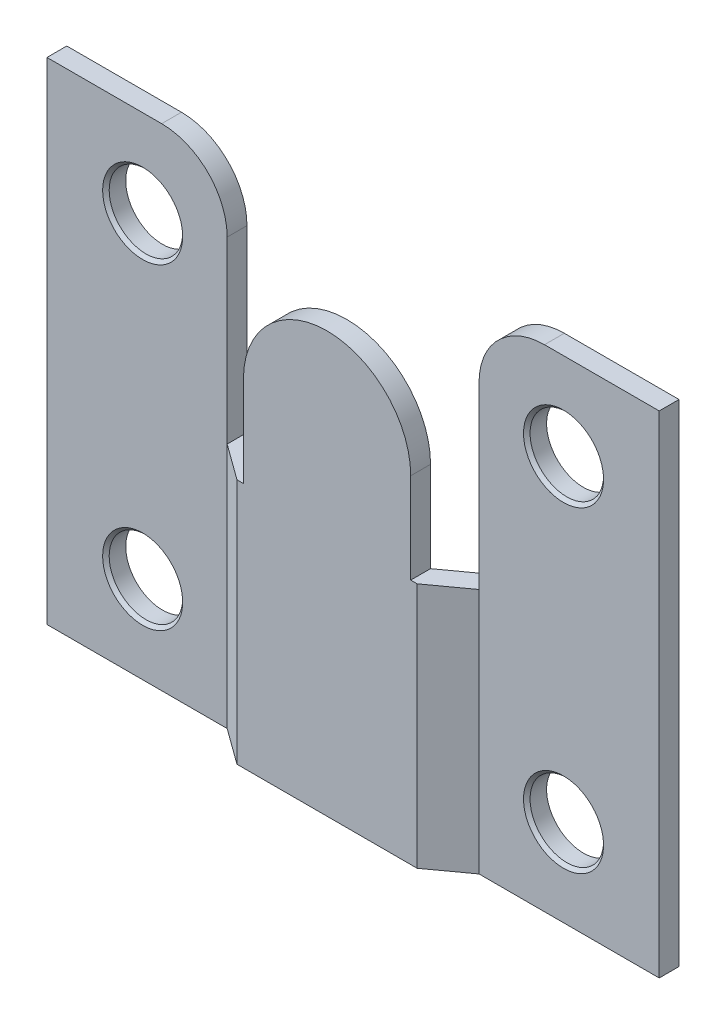
ISO-10303-21;
HEADER;
FILE_DESCRIPTION(('STEP AP214'),'2;1');
FILE_NAME('part.step','',(''),(''),'','','');
FILE_SCHEMA(('AUTOMOTIVE_DESIGN { 1 0 10303 214 1 1 1 1 }'));
ENDSEC;
DATA;
#1=APPLICATION_CONTEXT('core data for automotive mechanical design processes');
#2=APPLICATION_PROTOCOL_DEFINITION('international standard','automotive_design',2000,#1);
#3=PRODUCT_CONTEXT('',#1,'mechanical');
#4=PRODUCT('Part','Part','',(#3));
#5=PRODUCT_RELATED_PRODUCT_CATEGORY('part','',(#4));
#6=PRODUCT_DEFINITION_FORMATION('','',#4);
#7=PRODUCT_DEFINITION_CONTEXT('part definition',#1,'design');
#8=PRODUCT_DEFINITION('design','',#6,#7);
#9=PRODUCT_DEFINITION_SHAPE('','',#8);
#10=(LENGTH_UNIT() NAMED_UNIT(*) SI_UNIT(.MILLI.,.METRE.));
#11=(NAMED_UNIT(*) PLANE_ANGLE_UNIT() SI_UNIT($,.RADIAN.));
#12=(NAMED_UNIT(*) SI_UNIT($,.STERADIAN.) SOLID_ANGLE_UNIT());
#13=UNCERTAINTY_MEASURE_WITH_UNIT(LENGTH_MEASURE(1.E-05),#10,'distance_accuracy_value','');
#14=(GEOMETRIC_REPRESENTATION_CONTEXT(3) GLOBAL_UNCERTAINTY_ASSIGNED_CONTEXT((#13)) GLOBAL_UNIT_ASSIGNED_CONTEXT((#10,
#11,#12)) REPRESENTATION_CONTEXT('',''));
#15=CARTESIAN_POINT('',(0.,0.,0.));
#16=DIRECTION('',(0.,0.,1.));
#17=DIRECTION('',(1.,0.,0.));
#18=AXIS2_PLACEMENT_3D('',#15,#16,#17);
#19=CARTESIAN_POINT('',(0.,38.1,0.));
#20=DIRECTION('',(0.,-1.,0.));
#21=DIRECTION('',(0.,0.,-1.));
#22=AXIS2_PLACEMENT_3D('',#19,#20,#21);
#23=PLANE('',#22);
#24=DIRECTION('',(1.,0.,0.));
#25=VECTOR('',#24,1.);
#26=CARTESIAN_POINT('',(-9.77010987578546,38.1,-2.0193));
#27=LINE('',#26,#25);
#28=CARTESIAN_POINT('',(-23.7489999999999,38.1,-2.0193));
#29=VERTEX_POINT('',#28);
#30=CARTESIAN_POINT('',(-14.8501098757855,38.1,-2.0193));
#31=VERTEX_POINT('',#30);
#32=EDGE_CURVE('E224',#29,#31,#27,.T.);
#33=ORIENTED_EDGE('',*,*,#32,.T.);
#34=DIRECTION('',(0.,0.,-1.));
#35=VECTOR('',#34,1.);
#36=CARTESIAN_POINT('',(-14.8501098757855,38.1,0.));
#37=LINE('',#36,#35);
#38=CARTESIAN_POINT('',(-14.8501098757855,38.1,-3.55600000000001));
#39=VERTEX_POINT('',#38);
#40=EDGE_CURVE('E301',#31,#39,#37,.T.);
#41=ORIENTED_EDGE('',*,*,#40,.T.);
#42=DIRECTION('',(-1.,0.,0.));
#43=VECTOR('',#42,1.);
#44=CARTESIAN_POINT('',(-9.27099999999984,38.1,-3.55600000000001));
#45=LINE('',#44,#43);
#46=CARTESIAN_POINT('',(-23.7489999999999,38.1,-3.55600000000001));
#47=VERTEX_POINT('',#46);
#48=EDGE_CURVE('E220',#39,#47,#45,.T.);
#49=ORIENTED_EDGE('',*,*,#48,.T.);
#50=DIRECTION('',(0.,0.,1.));
#51=VECTOR('',#50,1.);
#52=CARTESIAN_POINT('',(-23.7489999999999,38.1,-3.55600000000001));
#53=LINE('',#52,#51);
#54=EDGE_CURVE('E222',#47,#29,#53,.T.);
#55=ORIENTED_EDGE('',*,*,#54,.T.);
#56=EDGE_LOOP('',(#33,#41,#49,#55));
#57=FACE_BOUND('',#56,.T.);
#58=ADVANCED_FACE('F37',(#57),#23,.F.);
#59=CARTESIAN_POINT('',(9.77010987578566,38.1,-2.01930000000001));
#60=DIRECTION('',(0.,0.,-1.));
#61=DIRECTION('',(-1.,0.,0.));
#62=AXIS2_PLACEMENT_3D('',#59,#60,#61);
#63=PLANE('',#62);
#64=CARTESIAN_POINT('',(16.32585,6.76275,-2.01930000000001));
#65=DIRECTION('',(0.,0.,-1.));
#66=DIRECTION('',(-1.,0.,0.));
#67=AXIS2_PLACEMENT_3D('',#64,#65,#66);
#68=CIRCLE('',#67,3.10514999999999);
#69=CARTESIAN_POINT('',(13.2207,6.76275,-2.01930000000001));
#70=VERTEX_POINT('',#69);
#71=EDGE_CURVE('E311',#70,#70,#68,.T.);
#72=ORIENTED_EDGE('',*,*,#71,.T.);
#73=EDGE_LOOP('',(#72));
#74=FACE_BOUND('',#73,.T.);
#75=CARTESIAN_POINT('',(16.32585,31.33725,-2.01930000000001));
#76=DIRECTION('',(0.,0.,-1.));
#77=DIRECTION('',(-1.,0.,0.));
#78=AXIS2_PLACEMENT_3D('',#75,#76,#77);
#79=CIRCLE('',#78,3.10514999999999);
#80=CARTESIAN_POINT('',(13.2207,31.33725,-2.01930000000001));
#81=VERTEX_POINT('',#80);
#82=EDGE_CURVE('E308',#81,#81,#79,.T.);
#83=ORIENTED_EDGE('',*,*,#82,.T.);
#84=EDGE_LOOP('',(#83));
#85=FACE_BOUND('',#84,.T.);
#86=DIRECTION('',(1.,0.,0.));
#87=VECTOR('',#86,1.);
#88=CARTESIAN_POINT('',(9.77010987578566,38.1,-2.01930000000001));
#89=LINE('',#88,#87);
#90=CARTESIAN_POINT('',(14.8501098757855,38.1,-2.01930000000001));
#91=VERTEX_POINT('',#90);
#92=CARTESIAN_POINT('',(23.7490000000001,38.1,-2.01930000000001));
#93=VERTEX_POINT('',#92);
#94=EDGE_CURVE('E212',#91,#93,#89,.T.);
#95=ORIENTED_EDGE('',*,*,#94,.F.);
#96=CARTESIAN_POINT('',(14.8501098757855,33.02,-2.01930000000001));
#97=DIRECTION('',(0.,0.,-1.));
#98=DIRECTION('',(-1.,0.,0.));
#99=AXIS2_PLACEMENT_3D('',#96,#97,#98);
#100=CIRCLE('',#99,5.08);
#101=CARTESIAN_POINT('',(9.77010987578566,33.02,-2.01930000000001));
#102=VERTEX_POINT('',#101);
#103=EDGE_CURVE('E299',#91,#102,#100,.F.);
#104=ORIENTED_EDGE('',*,*,#103,.T.);
#105=DIRECTION('',(0.,-1.,0.));
#106=VECTOR('',#105,1.);
#107=CARTESIAN_POINT('',(9.77010987578566,38.1,-2.01930000000001));
#108=LINE('',#107,#106);
#109=CARTESIAN_POINT('',(9.77010987578546,19.1135,-2.0193));
#110=VERTEX_POINT('',#109);
#111=EDGE_CURVE('E259',#102,#110,#108,.T.);
#112=ORIENTED_EDGE('',*,*,#111,.T.);
#113=CARTESIAN_POINT('',(9.77010987578566,0.,-2.01930000000001));
#114=VERTEX_POINT('',#113);
#115=EDGE_CURVE('E227',#110,#114,#108,.T.);
#116=ORIENTED_EDGE('',*,*,#115,.T.);
#117=DIRECTION('',(1.,0.,0.));
#118=VECTOR('',#117,1.);
#119=CARTESIAN_POINT('',(9.77010987578566,0.,-2.01930000000001));
#120=LINE('',#119,#118);
#121=CARTESIAN_POINT('',(23.7490000000001,0.,-2.01930000000001));
#122=VERTEX_POINT('',#121);
#123=EDGE_CURVE('E211',#114,#122,#120,.T.);
#124=ORIENTED_EDGE('',*,*,#123,.T.);
#125=DIRECTION('',(0.,-1.,0.));
#126=VECTOR('',#125,1.);
#127=CARTESIAN_POINT('',(23.7490000000001,38.1,-2.01930000000001));
#128=LINE('',#127,#126);
#129=EDGE_CURVE('E287',#93,#122,#128,.T.);
#130=ORIENTED_EDGE('',*,*,#129,.F.);
#131=EDGE_LOOP('',(#95,#104,#112,#116,#124,#130));
#132=FACE_BOUND('',#131,.T.);
#133=ADVANCED_FACE('F337',(#74,#85,#132),#63,.F.);
#134=CARTESIAN_POINT('',(23.7490000000001,38.1,-3.55600000000001));
#135=DIRECTION('',(-1.,0.,0.));
#136=DIRECTION('',(0.,0.,1.));
#137=AXIS2_PLACEMENT_3D('',#134,#135,#136);
#138=PLANE('',#137);
#139=DIRECTION('',(0.,0.,-1.));
#140=VECTOR('',#139,1.);
#141=CARTESIAN_POINT('',(23.7490000000001,0.,-3.55600000000001));
#142=LINE('',#141,#140);
#143=CARTESIAN_POINT('',(23.7490000000001,0.,-3.55600000000001));
#144=VERTEX_POINT('',#143);
#145=EDGE_CURVE('E230',#122,#144,#142,.T.);
#146=ORIENTED_EDGE('',*,*,#145,.T.);
#147=DIRECTION('',(0.,-1.,0.));
#148=VECTOR('',#147,1.);
#149=CARTESIAN_POINT('',(23.7490000000001,38.1,-3.55600000000001));
#150=LINE('',#149,#148);
#151=CARTESIAN_POINT('',(23.7490000000001,38.1,-3.55600000000001));
#152=VERTEX_POINT('',#151);
#153=EDGE_CURVE('E284',#152,#144,#150,.T.);
#154=ORIENTED_EDGE('',*,*,#153,.F.);
#155=DIRECTION('',(0.,0.,-1.));
#156=VECTOR('',#155,1.);
#157=CARTESIAN_POINT('',(23.7490000000001,38.1,-3.55600000000001));
#158=LINE('',#157,#156);
#159=EDGE_CURVE('E214',#93,#152,#158,.T.);
#160=ORIENTED_EDGE('',*,*,#159,.F.);
#161=ORIENTED_EDGE('',*,*,#129,.T.);
#162=EDGE_LOOP('',(#146,#154,#160,#161));
#163=FACE_BOUND('',#162,.T.);
#164=ADVANCED_FACE('F340',(#163),#138,.F.);
#165=CARTESIAN_POINT('',(9.27100000000009,38.1,-3.55600000000001));
#166=DIRECTION('',(0.,0.,1.));
#167=DIRECTION('',(1.,0.,0.));
#168=AXIS2_PLACEMENT_3D('',#165,#166,#167);
#169=PLANE('',#168);
#170=CARTESIAN_POINT('',(16.32585,31.33725,-3.55600000000013));
#171=DIRECTION('',(0.,0.,1.));
#172=DIRECTION('',(1.,0.,0.));
#173=AXIS2_PLACEMENT_3D('',#170,#171,#172);
#174=CIRCLE('',#173,2.85115);
#175=CARTESIAN_POINT('',(19.177,31.33725,-3.55600000000013));
#176=VERTEX_POINT('',#175);
#177=EDGE_CURVE('E441',#176,#176,#174,.T.);
#178=ORIENTED_EDGE('',*,*,#177,.T.);
#179=EDGE_LOOP('',(#178));
#180=FACE_BOUND('',#179,.T.);
#181=CARTESIAN_POINT('',(16.32585,6.76275,-3.55600000000013));
#182=DIRECTION('',(0.,0.,1.));
#183=DIRECTION('',(1.,0.,0.));
#184=AXIS2_PLACEMENT_3D('',#181,#182,#183);
#185=CIRCLE('',#184,2.85115);
#186=CARTESIAN_POINT('',(19.177,6.76275,-3.55600000000013));
#187=VERTEX_POINT('',#186);
#188=EDGE_CURVE('E438',#187,#187,#185,.T.);
#189=ORIENTED_EDGE('',*,*,#188,.T.);
#190=EDGE_LOOP('',(#189));
#191=FACE_BOUND('',#190,.T.);
#192=DIRECTION('',(0.,1.,0.));
#193=VECTOR('',#192,1.);
#194=CARTESIAN_POINT('',(9.77010987578546,38.1,-3.55600000000001));
#195=LINE('',#194,#193);
#196=CARTESIAN_POINT('',(9.77010987578546,19.1135,-3.55600000000001));
#197=VERTEX_POINT('',#196);
#198=CARTESIAN_POINT('',(9.77010987578546,33.02,-3.55600000000001));
#199=VERTEX_POINT('',#198);
#200=EDGE_CURVE('E357',#197,#199,#195,.T.);
#201=ORIENTED_EDGE('',*,*,#200,.T.);
#202=CARTESIAN_POINT('',(14.8501098757855,33.02,-3.55600000000001));
#203=DIRECTION('',(0.,0.,1.));
#204=DIRECTION('',(1.,0.,0.));
#205=AXIS2_PLACEMENT_3D('',#202,#203,#204);
#206=CIRCLE('',#205,5.08);
#207=CARTESIAN_POINT('',(14.8501098757855,38.1,-3.55600000000001));
#208=VERTEX_POINT('',#207);
#209=EDGE_CURVE('E295',#199,#208,#206,.F.);
#210=ORIENTED_EDGE('',*,*,#209,.T.);
#211=DIRECTION('',(-1.,0.,0.));
#212=VECTOR('',#211,1.);
#213=CARTESIAN_POINT('',(9.27100000000009,38.1,-3.55600000000001));
#214=LINE('',#213,#212);
#215=EDGE_CURVE('E217',#152,#208,#214,.T.);
#216=ORIENTED_EDGE('',*,*,#215,.F.);
#217=ORIENTED_EDGE('',*,*,#153,.T.);
#218=DIRECTION('',(-1.,0.,0.));
#219=VECTOR('',#218,1.);
#220=CARTESIAN_POINT('',(9.27100000000009,0.,-3.55600000000001));
#221=LINE('',#220,#219);
#222=CARTESIAN_POINT('',(9.27100000000009,0.,-3.55600000000001));
#223=VERTEX_POINT('',#222);
#224=EDGE_CURVE('E232',#144,#223,#221,.T.);
#225=ORIENTED_EDGE('',*,*,#224,.T.);
#226=DIRECTION('',(0.,-1.,0.));
#227=VECTOR('',#226,1.);
#228=CARTESIAN_POINT('',(9.27100000000009,38.1,-3.55600000000001));
#229=LINE('',#228,#227);
#230=CARTESIAN_POINT('',(9.271,19.1135,-3.55600000000013));
#231=VERTEX_POINT('',#230);
#232=EDGE_CURVE('E282',#231,#223,#229,.T.);
#233=ORIENTED_EDGE('',*,*,#232,.F.);
#234=DIRECTION('',(1.,0.,0.));
#235=VECTOR('',#234,1.);
#236=CARTESIAN_POINT('',(9.27100000000009,19.1135,-3.55600000000001));
#237=LINE('',#236,#235);
#238=EDGE_CURVE('E364',#231,#197,#237,.T.);
#239=ORIENTED_EDGE('',*,*,#238,.T.);
#240=EDGE_LOOP('',(#201,#210,#216,#217,#225,#233,#239));
#241=FACE_BOUND('',#240,.T.);
#242=ADVANCED_FACE('F361',(#180,#191,#241),#169,.F.);
#243=CARTESIAN_POINT('',(9.27100000000009,38.1,-3.55600000000001));
#244=DIRECTION('',(0.587600257069943,0.,0.809151368960924));
#245=DIRECTION('',(0.809151368960923,0.,-0.587600257069943));
#246=AXIS2_PLACEMENT_3D('',#243,#244,#245);
#247=PLANE('',#246);
#248=DIRECTION('',(0.,-1.,0.));
#249=VECTOR('',#248,1.);
#250=CARTESIAN_POINT('',(6.49033518632165,38.1,-1.5367));
#251=LINE('',#250,#249);
#252=CARTESIAN_POINT('',(6.4903351863216,19.1135,-1.5367));
#253=VERTEX_POINT('',#252);
#254=CARTESIAN_POINT('',(6.49033518632165,0.,-1.5367));
#255=VERTEX_POINT('',#254);
#256=EDGE_CURVE('E279',#253,#255,#251,.T.);
#257=ORIENTED_EDGE('',*,*,#256,.F.);
#258=DIRECTION('',(-0.809151368960903,0.,0.587600257069972));
#259=VECTOR('',#258,1.);
#260=CARTESIAN_POINT('',(6.4903351863216,19.1135,-1.5367));
#261=LINE('',#260,#259);
#262=EDGE_CURVE('E365',#231,#253,#261,.T.);
#263=ORIENTED_EDGE('',*,*,#262,.F.);
#264=ORIENTED_EDGE('',*,*,#232,.T.);
#265=DIRECTION('',(-0.809151368960923,0.,0.587600257069943));
#266=VECTOR('',#265,1.);
#267=CARTESIAN_POINT('',(9.27100000000009,0.,-3.55600000000001));
#268=LINE('',#267,#266);
#269=EDGE_CURVE('E235',#223,#255,#268,.T.);
#270=ORIENTED_EDGE('',*,*,#269,.T.);
#271=EDGE_LOOP('',(#257,#263,#264,#270));
#272=FACE_BOUND('',#271,.T.);
#273=ADVANCED_FACE('F478',(#272),#247,.F.);
#274=CARTESIAN_POINT('',(6.49033518632165,38.1,-1.5367));
#275=DIRECTION('',(0.,0.,1.));
#276=DIRECTION('',(1.,0.,0.));
#277=AXIS2_PLACEMENT_3D('',#274,#275,#276);
#278=PLANE('',#277);
#279=DIRECTION('',(0.,-1.,0.));
#280=VECTOR('',#279,1.);
#281=CARTESIAN_POINT('',(-6.4903351863216,38.1,-1.5367));
#282=LINE('',#281,#280);
#283=CARTESIAN_POINT('',(-6.49033518632161,26.1232648136784,-1.5367));
#284=VERTEX_POINT('',#283);
#285=CARTESIAN_POINT('',(-6.4903351863216,19.1135,-1.5367));
#286=VERTEX_POINT('',#285);
#287=EDGE_CURVE('E277',#284,#286,#282,.T.);
#288=ORIENTED_EDGE('',*,*,#287,.F.);
#289=CARTESIAN_POINT('',(0.,26.1232648136784,-1.5367));
#290=DIRECTION('',(0.,0.,1.));
#291=DIRECTION('',(1.,0.,0.));
#292=AXIS2_PLACEMENT_3D('',#289,#290,#291);
#293=CIRCLE('',#292,6.4903351863216);
#294=CARTESIAN_POINT('',(6.4903351863216,26.1232648136784,-1.5367));
#295=VERTEX_POINT('',#294);
#296=EDGE_CURVE('E179',#284,#295,#293,.F.);
#297=ORIENTED_EDGE('',*,*,#296,.T.);
#298=EDGE_CURVE('E280',#295,#253,#251,.T.);
#299=ORIENTED_EDGE('',*,*,#298,.T.);
#300=ORIENTED_EDGE('',*,*,#256,.T.);
#301=DIRECTION('',(-1.,0.,0.));
#302=VECTOR('',#301,1.);
#303=CARTESIAN_POINT('',(6.49033518632165,0.,-1.5367));
#304=LINE('',#303,#302);
#305=CARTESIAN_POINT('',(-6.4903351863216,0.,-1.5367));
#306=VERTEX_POINT('',#305);
#307=EDGE_CURVE('E238',#255,#306,#304,.T.);
#308=ORIENTED_EDGE('',*,*,#307,.T.);
#309=EDGE_CURVE('E276',#286,#306,#282,.T.);
#310=ORIENTED_EDGE('',*,*,#309,.F.);
#311=EDGE_LOOP('',(#288,#297,#299,#300,#308,#310));
#312=FACE_BOUND('',#311,.T.);
#313=ADVANCED_FACE('F486',(#312),#278,.F.);
#314=CARTESIAN_POINT('',(-6.4903351863216,38.1,-1.5367));
#315=DIRECTION('',(-0.587600257069972,0.,0.809151368960903));
#316=DIRECTION('',(0.809151368960903,0.,0.587600257069972));
#317=AXIS2_PLACEMENT_3D('',#314,#315,#316);
#318=PLANE('',#317);
#319=DIRECTION('',(0.,-1.,0.));
#320=VECTOR('',#319,1.);
#321=CARTESIAN_POINT('',(-9.27099999999984,38.1,-3.55600000000001));
#322=LINE('',#321,#320);
#323=CARTESIAN_POINT('',(-9.27099999999984,19.1135,-3.55600000000001));
#324=VERTEX_POINT('',#323);
#325=CARTESIAN_POINT('',(-9.27099999999984,0.,-3.55600000000001));
#326=VERTEX_POINT('',#325);
#327=EDGE_CURVE('E274',#324,#326,#322,.T.);
#328=ORIENTED_EDGE('',*,*,#327,.F.);
#329=DIRECTION('',(-0.809151368960903,0.,-0.587600257069972));
#330=VECTOR('',#329,1.);
#331=CARTESIAN_POINT('',(-6.4903351863216,19.1135,-1.5367));
#332=LINE('',#331,#330);
#333=EDGE_CURVE('E205',#286,#324,#332,.T.);
#334=ORIENTED_EDGE('',*,*,#333,.F.);
#335=ORIENTED_EDGE('',*,*,#309,.T.);
#336=DIRECTION('',(-0.809151368960903,0.,-0.587600257069972));
#337=VECTOR('',#336,1.);
#338=CARTESIAN_POINT('',(-6.4903351863216,0.,-1.5367));
#339=LINE('',#338,#337);
#340=EDGE_CURVE('E241',#306,#326,#339,.T.);
#341=ORIENTED_EDGE('',*,*,#340,.T.);
#342=EDGE_LOOP('',(#328,#334,#335,#341));
#343=FACE_BOUND('',#342,.T.);
#344=ADVANCED_FACE('F387',(#343),#318,.F.);
#345=CARTESIAN_POINT('',(-9.27099999999984,38.1,-3.55600000000001));
#346=DIRECTION('',(0.,0.,1.));
#347=DIRECTION('',(1.,0.,0.));
#348=AXIS2_PLACEMENT_3D('',#345,#346,#347);
#349=PLANE('',#348);
#350=CARTESIAN_POINT('',(-16.32585,6.76275,-3.55600000000013));
#351=DIRECTION('',(0.,0.,1.));
#352=DIRECTION('',(1.,0.,0.));
#353=AXIS2_PLACEMENT_3D('',#350,#351,#352);
#354=CIRCLE('',#353,2.85115);
#355=CARTESIAN_POINT('',(-13.4747,6.76275,-3.55600000000013));
#356=VERTEX_POINT('',#355);
#357=EDGE_CURVE('E435',#356,#356,#354,.T.);
#358=ORIENTED_EDGE('',*,*,#357,.T.);
#359=EDGE_LOOP('',(#358));
#360=FACE_BOUND('',#359,.T.);
#361=CARTESIAN_POINT('',(-16.32585,31.33725,-3.55600000000013));
#362=DIRECTION('',(0.,0.,1.));
#363=DIRECTION('',(1.,0.,0.));
#364=AXIS2_PLACEMENT_3D('',#361,#362,#363);
#365=CIRCLE('',#364,2.85115);
#366=CARTESIAN_POINT('',(-13.4747,31.33725,-3.55600000000013));
#367=VERTEX_POINT('',#366);
#368=EDGE_CURVE('E193',#367,#367,#365,.T.);
#369=ORIENTED_EDGE('',*,*,#368,.T.);
#370=EDGE_LOOP('',(#369));
#371=FACE_BOUND('',#370,.T.);
#372=ORIENTED_EDGE('',*,*,#48,.F.);
#373=CARTESIAN_POINT('',(-14.8501098757855,33.02,-3.55600000000001));
#374=DIRECTION('',(0.,0.,1.));
#375=DIRECTION('',(1.,0.,0.));
#376=AXIS2_PLACEMENT_3D('',#373,#374,#375);
#377=CIRCLE('',#376,5.08);
#378=CARTESIAN_POINT('',(-9.77010987578546,33.02,-3.55600000000001));
#379=VERTEX_POINT('',#378);
#380=EDGE_CURVE('E60',#39,#379,#377,.F.);
#381=ORIENTED_EDGE('',*,*,#380,.T.);
#382=DIRECTION('',(0.,-1.,0.));
#383=VECTOR('',#382,1.);
#384=CARTESIAN_POINT('',(-9.77010987578546,38.1,-3.55600000000001));
#385=LINE('',#384,#383);
#386=CARTESIAN_POINT('',(-9.77010987578546,19.1135,-3.55600000000001));
#387=VERTEX_POINT('',#386);
#388=EDGE_CURVE('E199',#379,#387,#385,.T.);
#389=ORIENTED_EDGE('',*,*,#388,.T.);
#390=DIRECTION('',(1.,0.,0.));
#391=VECTOR('',#390,1.);
#392=CARTESIAN_POINT('',(-9.27099999999984,19.1135,-3.55600000000001));
#393=LINE('',#392,#391);
#394=EDGE_CURVE('E202',#387,#324,#393,.T.);
#395=ORIENTED_EDGE('',*,*,#394,.T.);
#396=ORIENTED_EDGE('',*,*,#327,.T.);
#397=DIRECTION('',(-1.,0.,0.));
#398=VECTOR('',#397,1.);
#399=CARTESIAN_POINT('',(-9.27099999999984,0.,-3.55600000000001));
#400=LINE('',#399,#398);
#401=CARTESIAN_POINT('',(-23.7489999999999,0.,-3.55600000000001));
#402=VERTEX_POINT('',#401);
#403=EDGE_CURVE('E244',#326,#402,#400,.T.);
#404=ORIENTED_EDGE('',*,*,#403,.T.);
#405=DIRECTION('',(0.,-1.,0.));
#406=VECTOR('',#405,1.);
#407=CARTESIAN_POINT('',(-23.7489999999999,38.1,-3.55600000000001));
#408=LINE('',#407,#406);
#409=EDGE_CURVE('E271',#47,#402,#408,.T.);
#410=ORIENTED_EDGE('',*,*,#409,.F.);
#411=EDGE_LOOP('',(#372,#381,#389,#395,#396,#404,#410));
#412=FACE_BOUND('',#411,.T.);
#413=ADVANCED_FACE('F386',(#360,#371,#412),#349,.F.);
#414=CARTESIAN_POINT('',(-23.7489999999999,38.1,-3.55600000000001));
#415=DIRECTION('',(1.,0.,0.));
#416=DIRECTION('',(0.,0.,-1.));
#417=AXIS2_PLACEMENT_3D('',#414,#415,#416);
#418=PLANE('',#417);
#419=DIRECTION('',(0.,0.,1.));
#420=VECTOR('',#419,1.);
#421=CARTESIAN_POINT('',(-23.7489999999999,0.,-3.55600000000001));
#422=LINE('',#421,#420);
#423=CARTESIAN_POINT('',(-23.7489999999999,0.,-2.0193));
#424=VERTEX_POINT('',#423);
#425=EDGE_CURVE('E246',#402,#424,#422,.T.);
#426=ORIENTED_EDGE('',*,*,#425,.T.);
#427=DIRECTION('',(0.,-1.,0.));
#428=VECTOR('',#427,1.);
#429=CARTESIAN_POINT('',(-23.7489999999999,38.1,-2.0193));
#430=LINE('',#429,#428);
#431=EDGE_CURVE('E268',#29,#424,#430,.T.);
#432=ORIENTED_EDGE('',*,*,#431,.F.);
#433=ORIENTED_EDGE('',*,*,#54,.F.);
#434=ORIENTED_EDGE('',*,*,#409,.T.);
#435=EDGE_LOOP('',(#426,#432,#433,#434));
#436=FACE_BOUND('',#435,.T.);
#437=ADVANCED_FACE('F399',(#436),#418,.F.);
#438=CARTESIAN_POINT('',(-9.77010987578546,38.1,-2.0193));
#439=DIRECTION('',(0.,0.,-1.));
#440=DIRECTION('',(-1.,0.,0.));
#441=AXIS2_PLACEMENT_3D('',#438,#439,#440);
#442=PLANE('',#441);
#443=CARTESIAN_POINT('',(-16.32585,6.76275,-2.0193));
#444=DIRECTION('',(0.,0.,-1.));
#445=DIRECTION('',(-1.,0.,0.));
#446=AXIS2_PLACEMENT_3D('',#443,#444,#445);
#447=CIRCLE('',#446,3.10515);
#448=CARTESIAN_POINT('',(-19.431,6.76275,-2.0193));
#449=VERTEX_POINT('',#448);
#450=EDGE_CURVE('E320',#449,#449,#447,.T.);
#451=ORIENTED_EDGE('',*,*,#450,.T.);
#452=EDGE_LOOP('',(#451));
#453=FACE_BOUND('',#452,.T.);
#454=CARTESIAN_POINT('',(-16.32585,31.33725,-2.0193));
#455=DIRECTION('',(0.,0.,-1.));
#456=DIRECTION('',(-1.,0.,0.));
#457=AXIS2_PLACEMENT_3D('',#454,#455,#456);
#458=CIRCLE('',#457,3.10515);
#459=CARTESIAN_POINT('',(-19.431,31.33725,-2.0193));
#460=VERTEX_POINT('',#459);
#461=EDGE_CURVE('E317',#460,#460,#458,.T.);
#462=ORIENTED_EDGE('',*,*,#461,.T.);
#463=EDGE_LOOP('',(#462));
#464=FACE_BOUND('',#463,.T.);
#465=DIRECTION('',(0.,-1.,0.));
#466=VECTOR('',#465,1.);
#467=CARTESIAN_POINT('',(-9.77010987578546,38.1,-2.0193));
#468=LINE('',#467,#466);
#469=CARTESIAN_POINT('',(-9.77010987578546,33.02,-2.0193));
#470=VERTEX_POINT('',#469);
#471=CARTESIAN_POINT('',(-9.77010987578546,19.1135,-2.0193));
#472=VERTEX_POINT('',#471);
#473=EDGE_CURVE('E266',#470,#472,#468,.T.);
#474=ORIENTED_EDGE('',*,*,#473,.F.);
#475=CARTESIAN_POINT('',(-14.8501098757855,33.02,-2.0193));
#476=DIRECTION('',(0.,0.,-1.));
#477=DIRECTION('',(-1.,0.,0.));
#478=AXIS2_PLACEMENT_3D('',#475,#476,#477);
#479=CIRCLE('',#478,5.08);
#480=EDGE_CURVE('E306',#470,#31,#479,.F.);
#481=ORIENTED_EDGE('',*,*,#480,.T.);
#482=ORIENTED_EDGE('',*,*,#32,.F.);
#483=ORIENTED_EDGE('',*,*,#431,.T.);
#484=DIRECTION('',(1.,0.,0.));
#485=VECTOR('',#484,1.);
#486=CARTESIAN_POINT('',(-9.77010987578546,0.,-2.0193));
#487=LINE('',#486,#485);
#488=CARTESIAN_POINT('',(-9.77010987578546,0.,-2.0193));
#489=VERTEX_POINT('',#488);
#490=EDGE_CURVE('E248',#424,#489,#487,.T.);
#491=ORIENTED_EDGE('',*,*,#490,.T.);
#492=EDGE_CURVE('E265',#472,#489,#468,.T.);
#493=ORIENTED_EDGE('',*,*,#492,.F.);
#494=EDGE_LOOP('',(#474,#481,#482,#483,#491,#493));
#495=FACE_BOUND('',#494,.T.);
#496=ADVANCED_FACE('F408',(#453,#464,#495),#442,.F.);
#497=CARTESIAN_POINT('',(-6.98944506210722,38.1,0.));
#498=DIRECTION('',(0.587600257069971,0.,-0.809151368960904));
#499=DIRECTION('',(-0.809151368960903,0.,-0.587600257069971));
#500=AXIS2_PLACEMENT_3D('',#497,#498,#499);
#501=PLANE('',#500);
#502=DIRECTION('',(0.,-1.,0.));
#503=VECTOR('',#502,1.);
#504=CARTESIAN_POINT('',(-6.98944506210722,38.1,0.));
#505=LINE('',#504,#503);
#506=CARTESIAN_POINT('',(-6.98944506210722,19.1135,0.));
#507=VERTEX_POINT('',#506);
#508=CARTESIAN_POINT('',(-6.98944506210722,0.,0.));
#509=VERTEX_POINT('',#508);
#510=EDGE_CURVE('E263',#507,#509,#505,.T.);
#511=ORIENTED_EDGE('',*,*,#510,.F.);
#512=DIRECTION('',(0.809151368960903,0.,0.587600257069971));
#513=VECTOR('',#512,1.);
#514=CARTESIAN_POINT('',(-9.77010987578546,19.1135,-2.0193));
#515=LINE('',#514,#513);
#516=EDGE_CURVE('E376',#472,#507,#515,.T.);
#517=ORIENTED_EDGE('',*,*,#516,.F.);
#518=ORIENTED_EDGE('',*,*,#492,.T.);
#519=DIRECTION('',(0.809151368960903,0.,0.587600257069971));
#520=VECTOR('',#519,1.);
#521=CARTESIAN_POINT('',(-6.98944506210722,0.,0.));
#522=LINE('',#521,#520);
#523=EDGE_CURVE('E251',#489,#509,#522,.T.);
#524=ORIENTED_EDGE('',*,*,#523,.T.);
#525=EDGE_LOOP('',(#511,#517,#518,#524));
#526=FACE_BOUND('',#525,.T.);
#527=ADVANCED_FACE('F414',(#526),#501,.F.);
#528=CARTESIAN_POINT('',(6.98944506210722,38.1,0.));
#529=DIRECTION('',(0.,0.,-1.));
#530=DIRECTION('',(-1.,0.,0.));
#531=AXIS2_PLACEMENT_3D('',#528,#529,#530);
#532=PLANE('',#531);
#533=DIRECTION('',(0.,1.,0.));
#534=VECTOR('',#533,1.);
#535=CARTESIAN_POINT('',(6.4903351863216,38.1,0.));
#536=LINE('',#535,#534);
#537=CARTESIAN_POINT('',(6.4903351863216,19.1135,0.));
#538=VERTEX_POINT('',#537);
#539=CARTESIAN_POINT('',(6.4903351863216,26.1232648136784,0.));
#540=VERTEX_POINT('',#539);
#541=EDGE_CURVE('E192',#538,#540,#536,.T.);
#542=ORIENTED_EDGE('',*,*,#541,.T.);
#543=CARTESIAN_POINT('',(0.,26.1232648136784,0.));
#544=DIRECTION('',(0.,0.,1.));
#545=DIRECTION('',(1.,0.,0.));
#546=AXIS2_PLACEMENT_3D('',#543,#544,#545);
#547=CIRCLE('',#546,6.4903351863216);
#548=CARTESIAN_POINT('',(-6.49033518632161,26.1232648136784,0.));
#549=VERTEX_POINT('',#548);
#550=EDGE_CURVE('E176',#540,#549,#547,.T.);
#551=ORIENTED_EDGE('',*,*,#550,.T.);
#552=DIRECTION('',(0.,-1.,0.));
#553=VECTOR('',#552,1.);
#554=CARTESIAN_POINT('',(-6.4903351863216,38.1,0.));
#555=LINE('',#554,#553);
#556=CARTESIAN_POINT('',(-6.4903351863216,19.1135,0.));
#557=VERTEX_POINT('',#556);
#558=EDGE_CURVE('E189',#549,#557,#555,.T.);
#559=ORIENTED_EDGE('',*,*,#558,.T.);
#560=DIRECTION('',(-1.,0.,0.));
#561=VECTOR('',#560,1.);
#562=CARTESIAN_POINT('',(6.98944506210722,19.1135,0.));
#563=LINE('',#562,#561);
#564=EDGE_CURVE('E290',#557,#507,#563,.T.);
#565=ORIENTED_EDGE('',*,*,#564,.T.);
#566=ORIENTED_EDGE('',*,*,#510,.T.);
#567=DIRECTION('',(1.,0.,0.));
#568=VECTOR('',#567,1.);
#569=CARTESIAN_POINT('',(6.98944506210722,0.,0.));
#570=LINE('',#569,#568);
#571=CARTESIAN_POINT('',(6.98944506210722,0.,0.));
#572=VERTEX_POINT('',#571);
#573=EDGE_CURVE('E254',#509,#572,#570,.T.);
#574=ORIENTED_EDGE('',*,*,#573,.T.);
#575=DIRECTION('',(0.,-1.,0.));
#576=VECTOR('',#575,1.);
#577=CARTESIAN_POINT('',(6.98944506210722,38.1,0.));
#578=LINE('',#577,#576);
#579=CARTESIAN_POINT('',(6.98944506210722,19.1135,0.));
#580=VERTEX_POINT('',#579);
#581=EDGE_CURVE('E261',#580,#572,#578,.T.);
#582=ORIENTED_EDGE('',*,*,#581,.F.);
#583=DIRECTION('',(-1.,0.,0.));
#584=VECTOR('',#583,1.);
#585=CARTESIAN_POINT('',(6.98944506210722,19.1135,0.));
#586=LINE('',#585,#584);
#587=EDGE_CURVE('E367',#580,#538,#586,.T.);
#588=ORIENTED_EDGE('',*,*,#587,.T.);
#589=EDGE_LOOP('',(#542,#551,#559,#565,#566,#574,#582,#588));
#590=FACE_BOUND('',#589,.T.);
#591=ADVANCED_FACE('F187',(#590),#532,.F.);
#592=CARTESIAN_POINT('',(9.77010987578566,38.1,-2.01930000000001));
#593=DIRECTION('',(-0.587600257069944,0.,-0.809151368960923));
#594=DIRECTION('',(-0.809151368960923,0.,0.587600257069944));
#595=AXIS2_PLACEMENT_3D('',#592,#593,#594);
#596=PLANE('',#595);
#597=ORIENTED_EDGE('',*,*,#115,.F.);
#598=DIRECTION('',(0.809151368960903,0.,-0.587600257069971));
#599=VECTOR('',#598,1.);
#600=CARTESIAN_POINT('',(9.77010987578546,19.1135,-2.0193));
#601=LINE('',#600,#599);
#602=EDGE_CURVE('E424',#580,#110,#601,.T.);
#603=ORIENTED_EDGE('',*,*,#602,.F.);
#604=ORIENTED_EDGE('',*,*,#581,.T.);
#605=DIRECTION('',(0.809151368960923,0.,-0.587600257069944));
#606=VECTOR('',#605,1.);
#607=CARTESIAN_POINT('',(9.77010987578566,0.,-2.01930000000001));
#608=LINE('',#607,#606);
#609=EDGE_CURVE('E215',#572,#114,#608,.T.);
#610=ORIENTED_EDGE('',*,*,#609,.T.);
#611=EDGE_LOOP('',(#597,#603,#604,#610));
#612=FACE_BOUND('',#611,.T.);
#613=ADVANCED_FACE('F421',(#612),#596,.F.);
#614=ORIENTED_EDGE('',*,*,#215,.T.);
#615=DIRECTION('',(0.,0.,-1.));
#616=VECTOR('',#615,1.);
#617=CARTESIAN_POINT('',(14.8501098757855,38.1,0.));
#618=LINE('',#617,#616);
#619=EDGE_CURVE('E297',#208,#91,#618,.F.);
#620=ORIENTED_EDGE('',*,*,#619,.T.);
#621=ORIENTED_EDGE('',*,*,#94,.T.);
#622=ORIENTED_EDGE('',*,*,#159,.T.);
#623=EDGE_LOOP('',(#614,#620,#621,#622));
#624=FACE_BOUND('',#623,.T.);
#625=ADVANCED_FACE('F461',(#624),#23,.F.);
#626=CARTESIAN_POINT('',(0.,0.,0.));
#627=DIRECTION('',(0.,-1.,0.));
#628=DIRECTION('',(0.,0.,-1.));
#629=AXIS2_PLACEMENT_3D('',#626,#627,#628);
#630=PLANE('',#629);
#631=ORIENTED_EDGE('',*,*,#123,.F.);
#632=ORIENTED_EDGE('',*,*,#609,.F.);
#633=ORIENTED_EDGE('',*,*,#573,.F.);
#634=ORIENTED_EDGE('',*,*,#523,.F.);
#635=ORIENTED_EDGE('',*,*,#490,.F.);
#636=ORIENTED_EDGE('',*,*,#425,.F.);
#637=ORIENTED_EDGE('',*,*,#403,.F.);
#638=ORIENTED_EDGE('',*,*,#340,.F.);
#639=ORIENTED_EDGE('',*,*,#307,.F.);
#640=ORIENTED_EDGE('',*,*,#269,.F.);
#641=ORIENTED_EDGE('',*,*,#224,.F.);
#642=ORIENTED_EDGE('',*,*,#145,.F.);
#643=EDGE_LOOP('',(#631,#632,#633,#634,#635,#636,#637,#638,#639,#640,#641,#642));
#644=FACE_BOUND('',#643,.T.);
#645=ADVANCED_FACE('F394',(#644),#630,.T.);
#646=CARTESIAN_POINT('',(0.,19.1135,0.));
#647=DIRECTION('',(0.,-1.,0.));
#648=DIRECTION('',(0.,0.,-1.));
#649=AXIS2_PLACEMENT_3D('',#646,#647,#648);
#650=PLANE('',#649);
#651=DIRECTION('',(0.,0.,1.));
#652=VECTOR('',#651,1.);
#653=CARTESIAN_POINT('',(-9.77010987578546,19.1135,-3.91845021953608));
#654=LINE('',#653,#652);
#655=EDGE_CURVE('E200',#387,#472,#654,.T.);
#656=ORIENTED_EDGE('',*,*,#655,.T.);
#657=ORIENTED_EDGE('',*,*,#516,.T.);
#658=ORIENTED_EDGE('',*,*,#564,.F.);
#659=DIRECTION('',(0.,0.,-1.));
#660=VECTOR('',#659,1.);
#661=CARTESIAN_POINT('',(-6.4903351863216,19.1135,-1.5367));
#662=LINE('',#661,#660);
#663=EDGE_CURVE('E198',#557,#286,#662,.T.);
#664=ORIENTED_EDGE('',*,*,#663,.T.);
#665=ORIENTED_EDGE('',*,*,#333,.T.);
#666=ORIENTED_EDGE('',*,*,#394,.F.);
#667=EDGE_LOOP('',(#656,#657,#658,#664,#665,#666));
#668=FACE_BOUND('',#667,.T.);
#669=ADVANCED_FACE('F381',(#668),#650,.F.);
#670=CARTESIAN_POINT('',(-9.77010987578546,19.1135,-3.91845021953608));
#671=DIRECTION('',(-1.,0.,0.));
#672=DIRECTION('',(0.,0.,1.));
#673=AXIS2_PLACEMENT_3D('',#670,#671,#672);
#674=PLANE('',#673);
#675=ORIENTED_EDGE('',*,*,#388,.F.);
#676=DIRECTION('',(0.,0.,-1.));
#677=VECTOR('',#676,1.);
#678=CARTESIAN_POINT('',(-9.77010987578546,33.02,-3.91845021953608));
#679=LINE('',#678,#677);
#680=EDGE_CURVE('E52',#379,#470,#679,.F.);
#681=ORIENTED_EDGE('',*,*,#680,.T.);
#682=ORIENTED_EDGE('',*,*,#473,.T.);
#683=ORIENTED_EDGE('',*,*,#655,.F.);
#684=EDGE_LOOP('',(#675,#681,#682,#683));
#685=FACE_BOUND('',#684,.T.);
#686=ADVANCED_FACE('F410',(#685),#674,.F.);
#687=CARTESIAN_POINT('',(-6.4903351863216,19.1135,-1.5367));
#688=DIRECTION('',(1.,0.,0.));
#689=DIRECTION('',(0.,0.,-1.));
#690=AXIS2_PLACEMENT_3D('',#687,#688,#689);
#691=PLANE('',#690);
#692=ORIENTED_EDGE('',*,*,#558,.F.);
#693=DIRECTION('',(0.,0.,-1.));
#694=VECTOR('',#693,1.);
#695=CARTESIAN_POINT('',(-6.49033518632161,26.1232648136784,0.));
#696=LINE('',#695,#694);
#697=EDGE_CURVE('E173',#549,#284,#696,.T.);
#698=ORIENTED_EDGE('',*,*,#697,.T.);
#699=ORIENTED_EDGE('',*,*,#287,.T.);
#700=ORIENTED_EDGE('',*,*,#663,.F.);
#701=EDGE_LOOP('',(#692,#698,#699,#700));
#702=FACE_BOUND('',#701,.T.);
#703=ADVANCED_FACE('F196',(#702),#691,.F.);
#704=CARTESIAN_POINT('',(0.,19.1135,0.));
#705=DIRECTION('',(0.,-1.,0.));
#706=DIRECTION('',(0.,0.,-1.));
#707=AXIS2_PLACEMENT_3D('',#704,#705,#706);
#708=PLANE('',#707);
#709=ORIENTED_EDGE('',*,*,#262,.T.);
#710=DIRECTION('',(0.,0.,1.));
#711=VECTOR('',#710,1.);
#712=CARTESIAN_POINT('',(6.4903351863216,19.1135,-1.5367));
#713=LINE('',#712,#711);
#714=EDGE_CURVE('E426',#253,#538,#713,.T.);
#715=ORIENTED_EDGE('',*,*,#714,.T.);
#716=ORIENTED_EDGE('',*,*,#587,.F.);
#717=ORIENTED_EDGE('',*,*,#602,.T.);
#718=DIRECTION('',(0.,0.,-1.));
#719=VECTOR('',#718,1.);
#720=CARTESIAN_POINT('',(9.77010987578546,19.1135,-3.91845021953608));
#721=LINE('',#720,#719);
#722=EDGE_CURVE('E370',#110,#197,#721,.T.);
#723=ORIENTED_EDGE('',*,*,#722,.T.);
#724=ORIENTED_EDGE('',*,*,#238,.F.);
#725=EDGE_LOOP('',(#709,#715,#716,#717,#723,#724));
#726=FACE_BOUND('',#725,.T.);
#727=ADVANCED_FACE('F481',(#726),#708,.F.);
#728=CARTESIAN_POINT('',(6.4903351863216,19.1135,-1.5367));
#729=DIRECTION('',(-1.,0.,0.));
#730=DIRECTION('',(0.,0.,1.));
#731=AXIS2_PLACEMENT_3D('',#728,#729,#730);
#732=PLANE('',#731);
#733=ORIENTED_EDGE('',*,*,#298,.F.);
#734=DIRECTION('',(0.,0.,-1.));
#735=VECTOR('',#734,1.);
#736=CARTESIAN_POINT('',(6.4903351863216,26.1232648136784,0.));
#737=LINE('',#736,#735);
#738=EDGE_CURVE('E183',#540,#295,#737,.T.);
#739=ORIENTED_EDGE('',*,*,#738,.F.);
#740=ORIENTED_EDGE('',*,*,#541,.F.);
#741=ORIENTED_EDGE('',*,*,#714,.F.);
#742=EDGE_LOOP('',(#733,#739,#740,#741));
#743=FACE_BOUND('',#742,.T.);
#744=ADVANCED_FACE('F484',(#743),#732,.F.);
#745=CARTESIAN_POINT('',(9.77010987578546,19.1135,-3.91845021953608));
#746=DIRECTION('',(1.,0.,0.));
#747=DIRECTION('',(0.,0.,-1.));
#748=AXIS2_PLACEMENT_3D('',#745,#746,#747);
#749=PLANE('',#748);
#750=ORIENTED_EDGE('',*,*,#111,.F.);
#751=DIRECTION('',(0.,0.,-1.));
#752=VECTOR('',#751,1.);
#753=CARTESIAN_POINT('',(9.77010987578546,33.02,-3.91845021953608));
#754=LINE('',#753,#752);
#755=EDGE_CURVE('E292',#102,#199,#754,.T.);
#756=ORIENTED_EDGE('',*,*,#755,.T.);
#757=ORIENTED_EDGE('',*,*,#200,.F.);
#758=ORIENTED_EDGE('',*,*,#722,.F.);
#759=EDGE_LOOP('',(#750,#756,#757,#758));
#760=FACE_BOUND('',#759,.T.);
#761=ADVANCED_FACE('F355',(#760),#749,.F.);
#762=CARTESIAN_POINT('',(0.,26.1232648136784,0.));
#763=DIRECTION('',(0.,0.,-1.));
#764=DIRECTION('',(-1.,0.,0.));
#765=AXIS2_PLACEMENT_3D('',#762,#763,#764);
#766=CYLINDRICAL_SURFACE('',#765,6.4903351863216);
#767=ORIENTED_EDGE('',*,*,#697,.F.);
#768=ORIENTED_EDGE('',*,*,#550,.F.);
#769=ORIENTED_EDGE('',*,*,#738,.T.);
#770=ORIENTED_EDGE('',*,*,#296,.F.);
#771=EDGE_LOOP('',(#767,#768,#769,#770));
#772=FACE_BOUND('',#771,.T.);
#773=ADVANCED_FACE('F175',(#772),#766,.T.);
#774=CARTESIAN_POINT('',(14.8501098757855,33.02,-3.91845021953608));
#775=DIRECTION('',(0.,0.,-1.));
#776=DIRECTION('',(-1.,0.,0.));
#777=AXIS2_PLACEMENT_3D('',#774,#775,#776);
#778=CYLINDRICAL_SURFACE('',#777,5.08);
#779=ORIENTED_EDGE('',*,*,#103,.F.);
#780=ORIENTED_EDGE('',*,*,#619,.F.);
#781=ORIENTED_EDGE('',*,*,#209,.F.);
#782=ORIENTED_EDGE('',*,*,#755,.F.);
#783=EDGE_LOOP('',(#779,#780,#781,#782));
#784=FACE_BOUND('',#783,.T.);
#785=ADVANCED_FACE('F352',(#784),#778,.T.);
#786=CARTESIAN_POINT('',(-14.8501098757855,33.02,0.));
#787=DIRECTION('',(0.,0.,-1.));
#788=DIRECTION('',(-1.,0.,0.));
#789=AXIS2_PLACEMENT_3D('',#786,#787,#788);
#790=CYLINDRICAL_SURFACE('',#789,5.08);
#791=ORIENTED_EDGE('',*,*,#480,.F.);
#792=ORIENTED_EDGE('',*,*,#680,.F.);
#793=ORIENTED_EDGE('',*,*,#380,.F.);
#794=ORIENTED_EDGE('',*,*,#40,.F.);
#795=EDGE_LOOP('',(#791,#792,#793,#794));
#796=FACE_BOUND('',#795,.T.);
#797=ADVANCED_FACE('F406',(#796),#790,.T.);
#798=CARTESIAN_POINT('',(-16.32585,31.33725,-3.55600000000013));
#799=DIRECTION('',(0.,0.,1.));
#800=DIRECTION('',(1.,0.,0.));
#801=AXIS2_PLACEMENT_3D('',#798,#799,#800);
#802=CYLINDRICAL_SURFACE('',#801,2.85115);
#803=CARTESIAN_POINT('',(-16.32585,31.33725,-2.2733));
#804=DIRECTION('',(0.,0.,-1.));
#805=DIRECTION('',(-1.,0.,0.));
#806=AXIS2_PLACEMENT_3D('',#803,#804,#805);
#807=CIRCLE('',#806,2.85115);
#808=CARTESIAN_POINT('',(-19.177,31.33725,-2.2733));
#809=VERTEX_POINT('',#808);
#810=EDGE_CURVE('E11',#809,#809,#807,.F.);
#811=ORIENTED_EDGE('',*,*,#810,.T.);
#812=EDGE_LOOP('',(#811));
#813=FACE_BOUND('',#812,.T.);
#814=ORIENTED_EDGE('',*,*,#368,.F.);
#815=EDGE_LOOP('',(#814));
#816=FACE_BOUND('',#815,.T.);
#817=ADVANCED_FACE('F504',(#813,#816),#802,.F.);
#818=CARTESIAN_POINT('',(-16.32585,6.76275,-3.55600000000013));
#819=DIRECTION('',(0.,0.,1.));
#820=DIRECTION('',(1.,0.,0.));
#821=AXIS2_PLACEMENT_3D('',#818,#819,#820);
#822=CYLINDRICAL_SURFACE('',#821,2.85115);
#823=CARTESIAN_POINT('',(-16.32585,6.76275,-2.2733));
#824=DIRECTION('',(0.,0.,-1.));
#825=DIRECTION('',(-1.,0.,0.));
#826=AXIS2_PLACEMENT_3D('',#823,#824,#825);
#827=CIRCLE('',#826,2.85115);
#828=CARTESIAN_POINT('',(-19.177,6.76275,-2.2733));
#829=VERTEX_POINT('',#828);
#830=EDGE_CURVE('E323',#829,#829,#827,.F.);
#831=ORIENTED_EDGE('',*,*,#830,.T.);
#832=EDGE_LOOP('',(#831));
#833=FACE_BOUND('',#832,.T.);
#834=ORIENTED_EDGE('',*,*,#357,.F.);
#835=EDGE_LOOP('',(#834));
#836=FACE_BOUND('',#835,.T.);
#837=ADVANCED_FACE('F456',(#833,#836),#822,.F.);
#838=CARTESIAN_POINT('',(16.32585,6.76275,-3.55600000000013));
#839=DIRECTION('',(0.,0.,1.));
#840=DIRECTION('',(1.,0.,0.));
#841=AXIS2_PLACEMENT_3D('',#838,#839,#840);
#842=CYLINDRICAL_SURFACE('',#841,2.85115);
#843=CARTESIAN_POINT('',(16.32585,6.76275,-2.2733));
#844=DIRECTION('',(0.,0.,-1.));
#845=DIRECTION('',(-1.,0.,0.));
#846=AXIS2_PLACEMENT_3D('',#843,#844,#845);
#847=CIRCLE('',#846,2.85115);
#848=CARTESIAN_POINT('',(13.4747,6.76275,-2.2733));
#849=VERTEX_POINT('',#848);
#850=EDGE_CURVE('E314',#849,#849,#847,.F.);
#851=ORIENTED_EDGE('',*,*,#850,.T.);
#852=EDGE_LOOP('',(#851));
#853=FACE_BOUND('',#852,.T.);
#854=ORIENTED_EDGE('',*,*,#188,.F.);
#855=EDGE_LOOP('',(#854));
#856=FACE_BOUND('',#855,.T.);
#857=ADVANCED_FACE('F448',(#853,#856),#842,.F.);
#858=CARTESIAN_POINT('',(16.32585,31.33725,-3.55600000000013));
#859=DIRECTION('',(0.,0.,1.));
#860=DIRECTION('',(1.,0.,0.));
#861=AXIS2_PLACEMENT_3D('',#858,#859,#860);
#862=CYLINDRICAL_SURFACE('',#861,2.85115);
#863=CARTESIAN_POINT('',(16.32585,31.33725,-2.2733));
#864=DIRECTION('',(0.,0.,-1.));
#865=DIRECTION('',(-1.,0.,0.));
#866=AXIS2_PLACEMENT_3D('',#863,#864,#865);
#867=CIRCLE('',#866,2.85115);
#868=CARTESIAN_POINT('',(13.4747,31.33725,-2.2733));
#869=VERTEX_POINT('',#868);
#870=EDGE_CURVE('E45',#869,#869,#867,.F.);
#871=ORIENTED_EDGE('',*,*,#870,.T.);
#872=EDGE_LOOP('',(#871));
#873=FACE_BOUND('',#872,.T.);
#874=ORIENTED_EDGE('',*,*,#177,.F.);
#875=EDGE_LOOP('',(#874));
#876=FACE_BOUND('',#875,.T.);
#877=ADVANCED_FACE('F328',(#873,#876),#862,.F.);
#878=CARTESIAN_POINT('',(16.32585,6.76275,-2.01930000000001));
#879=DIRECTION('',(0.,0.,1.));
#880=DIRECTION('',(1.,0.,0.));
#881=AXIS2_PLACEMENT_3D('',#878,#879,#880);
#882=CONICAL_SURFACE('',#881,3.10514999999999,0.785398163397457);
#883=ORIENTED_EDGE('',*,*,#850,.F.);
#884=EDGE_LOOP('',(#883));
#885=FACE_BOUND('',#884,.T.);
#886=ORIENTED_EDGE('',*,*,#71,.F.);
#887=EDGE_LOOP('',(#886));
#888=FACE_BOUND('',#887,.T.);
#889=ADVANCED_FACE('F447',(#885,#888),#882,.F.);
#890=CARTESIAN_POINT('',(-16.32585,6.76275,-2.0193));
#891=DIRECTION('',(0.,0.,1.));
#892=DIRECTION('',(1.,0.,0.));
#893=AXIS2_PLACEMENT_3D('',#890,#891,#892);
#894=CONICAL_SURFACE('',#893,3.10515,0.785398163397457);
#895=ORIENTED_EDGE('',*,*,#830,.F.);
#896=EDGE_LOOP('',(#895));
#897=FACE_BOUND('',#896,.T.);
#898=ORIENTED_EDGE('',*,*,#450,.F.);
#899=EDGE_LOOP('',(#898));
#900=FACE_BOUND('',#899,.T.);
#901=ADVANCED_FACE('F334',(#897,#900),#894,.F.);
#902=CARTESIAN_POINT('',(16.32585,31.33725,-2.01930000000001));
#903=DIRECTION('',(0.,0.,1.));
#904=DIRECTION('',(1.,0.,0.));
#905=AXIS2_PLACEMENT_3D('',#902,#903,#904);
#906=CONICAL_SURFACE('',#905,3.10514999999999,0.785398163397456);
#907=ORIENTED_EDGE('',*,*,#870,.F.);
#908=EDGE_LOOP('',(#907));
#909=FACE_BOUND('',#908,.T.);
#910=ORIENTED_EDGE('',*,*,#82,.F.);
#911=EDGE_LOOP('',(#910));
#912=FACE_BOUND('',#911,.T.);
#913=ADVANCED_FACE('F331',(#909,#912),#906,.F.);
#914=CARTESIAN_POINT('',(-16.32585,31.33725,-2.0193));
#915=DIRECTION('',(0.,0.,1.));
#916=DIRECTION('',(1.,0.,0.));
#917=AXIS2_PLACEMENT_3D('',#914,#915,#916);
#918=CONICAL_SURFACE('',#917,3.10515,0.785398163397456);
#919=ORIENTED_EDGE('',*,*,#810,.F.);
#920=EDGE_LOOP('',(#919));
#921=FACE_BOUND('',#920,.T.);
#922=ORIENTED_EDGE('',*,*,#461,.F.);
#923=EDGE_LOOP('',(#922));
#924=FACE_BOUND('',#923,.T.);
#925=ADVANCED_FACE('F39',(#921,#924),#918,.F.);
#926=CLOSED_SHELL('',(#58,#133,#164,#242,#273,#313,#344,#413,#437,#496,#527,#591,#613,#625,#645,
#669,#686,#703,#727,#744,#761,#773,#785,#797,#817,#837,#857,#877,#889,#901,#913,#925));
#927=MANIFOLD_SOLID_BREP('B2',#926);
#928=ADVANCED_BREP_SHAPE_REPRESENTATION('',(#18,#927),#14);
#929=SHAPE_DEFINITION_REPRESENTATION(#9,#928);
ENDSEC;
END-ISO-10303-21;
